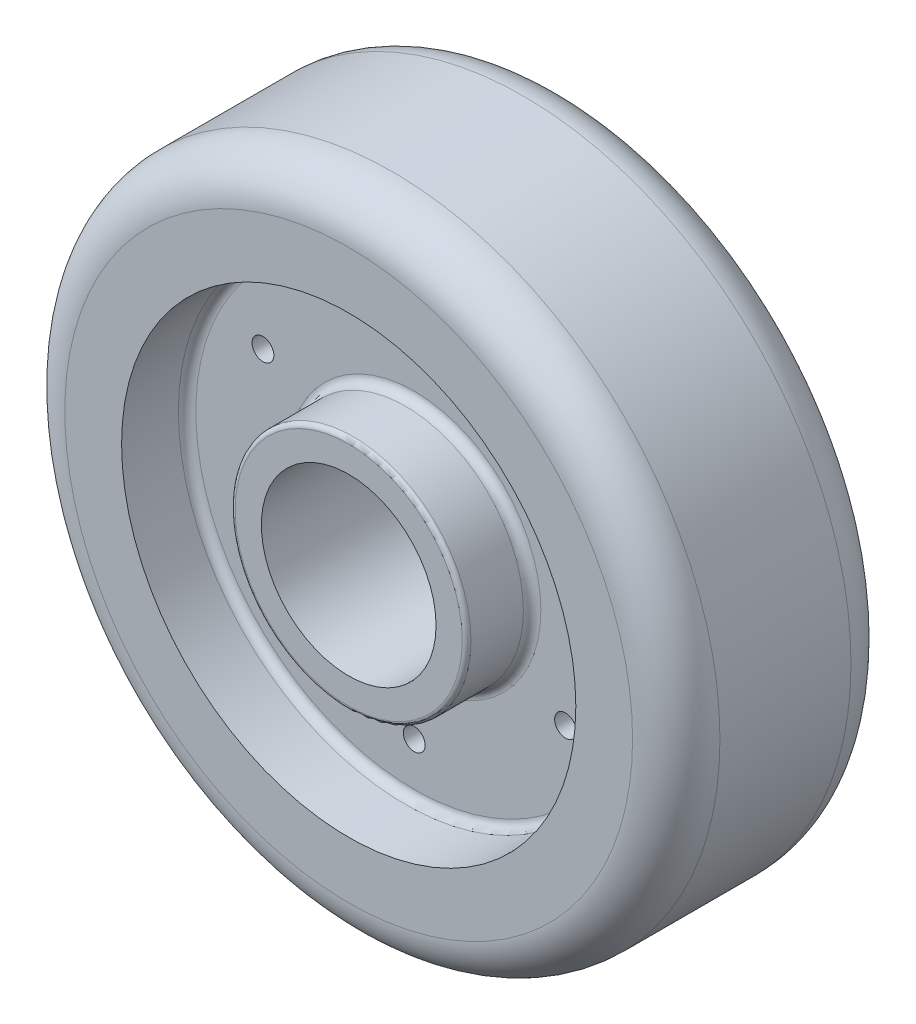
ISO-10303-21;
HEADER;
FILE_DESCRIPTION(('STEP AP214'),'2;1');
FILE_NAME('part.step','',(''),(''),'','','');
FILE_SCHEMA(('AUTOMOTIVE_DESIGN { 1 0 10303 214 1 1 1 1 }'));
ENDSEC;
DATA;
#1=APPLICATION_CONTEXT('core data for automotive mechanical design processes');
#2=APPLICATION_PROTOCOL_DEFINITION('international standard','automotive_design',2000,#1);
#3=PRODUCT_CONTEXT('',#1,'mechanical');
#4=PRODUCT('Part','Part','',(#3));
#5=PRODUCT_RELATED_PRODUCT_CATEGORY('part','',(#4));
#6=PRODUCT_DEFINITION_FORMATION('','',#4);
#7=PRODUCT_DEFINITION_CONTEXT('part definition',#1,'design');
#8=PRODUCT_DEFINITION('design','',#6,#7);
#9=PRODUCT_DEFINITION_SHAPE('','',#8);
#10=(LENGTH_UNIT() NAMED_UNIT(*) SI_UNIT(.MILLI.,.METRE.));
#11=(NAMED_UNIT(*) PLANE_ANGLE_UNIT() SI_UNIT($,.RADIAN.));
#12=(NAMED_UNIT(*) SI_UNIT($,.STERADIAN.) SOLID_ANGLE_UNIT());
#13=UNCERTAINTY_MEASURE_WITH_UNIT(LENGTH_MEASURE(1.E-05),#10,'distance_accuracy_value','');
#14=(GEOMETRIC_REPRESENTATION_CONTEXT(3) GLOBAL_UNCERTAINTY_ASSIGNED_CONTEXT((#13)) GLOBAL_UNIT_ASSIGNED_CONTEXT((#10,
#11,#12)) REPRESENTATION_CONTEXT('',''));
#15=CARTESIAN_POINT('',(0.,0.,0.));
#16=DIRECTION('',(0.,0.,1.));
#17=DIRECTION('',(1.,0.,0.));
#18=AXIS2_PLACEMENT_3D('',#15,#16,#17);
#19=CARTESIAN_POINT('',(0.,0.,25.));
#20=DIRECTION('',(0.,0.,-1.));
#21=DIRECTION('',(-1.,0.,0.));
#22=AXIS2_PLACEMENT_3D('',#19,#20,#21);
#23=CYLINDRICAL_SURFACE('',#22,75.);
#24=CARTESIAN_POINT('',(0.,0.,-15.));
#25=DIRECTION('',(0.,0.,1.));
#26=DIRECTION('',(1.,0.,0.));
#27=AXIS2_PLACEMENT_3D('',#24,#25,#26);
#28=CIRCLE('',#27,75.);
#29=CARTESIAN_POINT('',(75.,0.,-15.));
#30=VERTEX_POINT('',#29);
#31=EDGE_CURVE('E94',#30,#30,#28,.T.);
#32=ORIENTED_EDGE('',*,*,#31,.T.);
#33=EDGE_LOOP('',(#32));
#34=FACE_BOUND('',#33,.T.);
#35=CARTESIAN_POINT('',(0.,0.,15.));
#36=DIRECTION('',(0.,0.,1.));
#37=DIRECTION('',(1.,0.,0.));
#38=AXIS2_PLACEMENT_3D('',#35,#36,#37);
#39=CIRCLE('',#38,75.);
#40=CARTESIAN_POINT('',(75.,0.,15.));
#41=VERTEX_POINT('',#40);
#42=EDGE_CURVE('E91',#41,#41,#39,.F.);
#43=ORIENTED_EDGE('',*,*,#42,.T.);
#44=EDGE_LOOP('',(#43));
#45=FACE_BOUND('',#44,.T.);
#46=ADVANCED_FACE('F37',(#34,#45),#23,.T.);
#47=CARTESIAN_POINT('',(0.,0.,25.));
#48=DIRECTION('',(0.,0.,1.));
#49=DIRECTION('',(1.,0.,0.));
#50=AXIS2_PLACEMENT_3D('',#47,#48,#49);
#51=PLANE('',#50);
#52=CARTESIAN_POINT('',(0.,0.,25.));
#53=DIRECTION('',(0.,0.,1.));
#54=DIRECTION('',(1.,0.,0.));
#55=AXIS2_PLACEMENT_3D('',#52,#53,#54);
#56=CIRCLE('',#55,65.);
#57=CARTESIAN_POINT('',(65.,0.,25.));
#58=VERTEX_POINT('',#57);
#59=EDGE_CURVE('E100',#58,#58,#56,.T.);
#60=ORIENTED_EDGE('',*,*,#59,.T.);
#61=EDGE_LOOP('',(#60));
#62=FACE_BOUND('',#61,.T.);
#63=CARTESIAN_POINT('',(0.,0.,25.));
#64=DIRECTION('',(0.,0.,1.));
#65=DIRECTION('',(1.,0.,0.));
#66=AXIS2_PLACEMENT_3D('',#63,#64,#65);
#67=CIRCLE('',#66,52.);
#68=CARTESIAN_POINT('',(52.,0.,25.));
#69=VERTEX_POINT('',#68);
#70=EDGE_CURVE('E88',#69,#69,#67,.T.);
#71=ORIENTED_EDGE('',*,*,#70,.F.);
#72=EDGE_LOOP('',(#71));
#73=FACE_BOUND('',#72,.T.);
#74=ADVANCED_FACE('F149',(#62,#73),#51,.T.);
#75=CARTESIAN_POINT('',(0.,0.,-25.));
#76=DIRECTION('',(0.,0.,1.));
#77=DIRECTION('',(1.,0.,0.));
#78=AXIS2_PLACEMENT_3D('',#75,#76,#77);
#79=PLANE('',#78);
#80=CARTESIAN_POINT('',(0.,0.,-25.));
#81=DIRECTION('',(0.,0.,1.));
#82=DIRECTION('',(1.,0.,0.));
#83=AXIS2_PLACEMENT_3D('',#80,#81,#82);
#84=CIRCLE('',#83,65.);
#85=CARTESIAN_POINT('',(65.,0.,-25.));
#86=VERTEX_POINT('',#85);
#87=EDGE_CURVE('E97',#86,#86,#84,.F.);
#88=ORIENTED_EDGE('',*,*,#87,.T.);
#89=EDGE_LOOP('',(#88));
#90=FACE_BOUND('',#89,.T.);
#91=CARTESIAN_POINT('',(0.,0.,-25.));
#92=DIRECTION('',(0.,0.,-1.));
#93=DIRECTION('',(-1.,0.,0.));
#94=AXIS2_PLACEMENT_3D('',#91,#92,#93);
#95=CIRCLE('',#94,52.);
#96=CARTESIAN_POINT('',(-52.,0.,-25.));
#97=VERTEX_POINT('',#96);
#98=EDGE_CURVE('E80',#97,#97,#95,.T.);
#99=ORIENTED_EDGE('',*,*,#98,.F.);
#100=EDGE_LOOP('',(#99));
#101=FACE_BOUND('',#100,.T.);
#102=ADVANCED_FACE('F155',(#90,#101),#79,.F.);
#103=CARTESIAN_POINT('',(0.,0.,10.));
#104=DIRECTION('',(0.,0.,1.));
#105=DIRECTION('',(1.,0.,0.));
#106=AXIS2_PLACEMENT_3D('',#103,#104,#105);
#107=CYLINDRICAL_SURFACE('',#106,52.);
#108=CARTESIAN_POINT('',(0.,0.,12.));
#109=DIRECTION('',(0.,0.,1.));
#110=DIRECTION('',(1.,0.,0.));
#111=AXIS2_PLACEMENT_3D('',#108,#109,#110);
#112=CIRCLE('',#111,52.);
#113=CARTESIAN_POINT('',(52.,0.,12.));
#114=VERTEX_POINT('',#113);
#115=EDGE_CURVE('E106',#114,#114,#112,.F.);
#116=ORIENTED_EDGE('',*,*,#115,.T.);
#117=EDGE_LOOP('',(#116));
#118=FACE_BOUND('',#117,.T.);
#119=ORIENTED_EDGE('',*,*,#70,.T.);
#120=EDGE_LOOP('',(#119));
#121=FACE_BOUND('',#120,.T.);
#122=ADVANCED_FACE('F218',(#118,#121),#107,.F.);
#123=CARTESIAN_POINT('',(0.,0.,10.));
#124=DIRECTION('',(0.,0.,1.));
#125=DIRECTION('',(1.,0.,0.));
#126=AXIS2_PLACEMENT_3D('',#123,#124,#125);
#127=PLANE('',#126);
#128=CARTESIAN_POINT('',(0.,40.,10.));
#129=DIRECTION('',(0.,0.,1.));
#130=DIRECTION('',(1.,0.,0.));
#131=AXIS2_PLACEMENT_3D('',#128,#129,#130);
#132=CIRCLE('',#131,2.5);
#133=CARTESIAN_POINT('',(2.5,40.,10.));
#134=VERTEX_POINT('',#133);
#135=EDGE_CURVE('E58',#134,#134,#132,.T.);
#136=ORIENTED_EDGE('',*,*,#135,.F.);
#137=EDGE_LOOP('',(#136));
#138=FACE_BOUND('',#137,.T.);
#139=CARTESIAN_POINT('',(-34.6410161513767,19.9999999999985,10.));
#140=DIRECTION('',(0.,0.,1.));
#141=DIRECTION('',(1.,0.,0.));
#142=AXIS2_PLACEMENT_3D('',#139,#140,#141);
#143=CIRCLE('',#142,2.50000000000173);
#144=CARTESIAN_POINT('',(-32.141016151375,19.9999999999985,10.));
#145=VERTEX_POINT('',#144);
#146=EDGE_CURVE('E418',#145,#145,#143,.T.);
#147=ORIENTED_EDGE('',*,*,#146,.F.);
#148=EDGE_LOOP('',(#147));
#149=FACE_BOUND('',#148,.T.);
#150=CARTESIAN_POINT('',(-34.641016151375,-20.0000000000015,10.));
#151=DIRECTION('',(0.,0.,1.));
#152=DIRECTION('',(1.,0.,0.));
#153=AXIS2_PLACEMENT_3D('',#150,#151,#152);
#154=CIRCLE('',#153,2.50000000000323);
#155=CARTESIAN_POINT('',(-32.1410161513718,-20.0000000000015,10.));
#156=VERTEX_POINT('',#155);
#157=EDGE_CURVE('E83',#156,#156,#154,.T.);
#158=ORIENTED_EDGE('',*,*,#157,.F.);
#159=EDGE_LOOP('',(#158));
#160=FACE_BOUND('',#159,.T.);
#161=CARTESIAN_POINT('',(3.39590937005871E-12,-40.,10.));
#162=DIRECTION('',(0.,0.,1.));
#163=DIRECTION('',(1.,0.,0.));
#164=AXIS2_PLACEMENT_3D('',#161,#162,#163);
#165=CIRCLE('',#164,2.50000000000352);
#166=CARTESIAN_POINT('',(2.50000000000691,-40.,10.));
#167=VERTEX_POINT('',#166);
#168=EDGE_CURVE('E422',#167,#167,#165,.T.);
#169=ORIENTED_EDGE('',*,*,#168,.F.);
#170=EDGE_LOOP('',(#169));
#171=FACE_BOUND('',#170,.T.);
#172=CARTESIAN_POINT('',(34.6410161513801,-19.9999999999985,10.));
#173=DIRECTION('',(0.,0.,1.));
#174=DIRECTION('',(1.,0.,0.));
#175=AXIS2_PLACEMENT_3D('',#172,#173,#174);
#176=CIRCLE('',#175,2.50000000000219);
#177=CARTESIAN_POINT('',(37.1410161513823,-19.9999999999985,10.));
#178=VERTEX_POINT('',#177);
#179=EDGE_CURVE('E415',#178,#178,#176,.T.);
#180=ORIENTED_EDGE('',*,*,#179,.F.);
#181=EDGE_LOOP('',(#180));
#182=FACE_BOUND('',#181,.T.);
#183=CARTESIAN_POINT('',(34.6410161513784,20.0000000000015,10.));
#184=DIRECTION('',(0.,0.,1.));
#185=DIRECTION('',(1.,0.,0.));
#186=AXIS2_PLACEMENT_3D('',#183,#184,#185);
#187=CIRCLE('',#186,2.50000000000049);
#188=CARTESIAN_POINT('',(37.1410161513789,20.0000000000015,10.));
#189=VERTEX_POINT('',#188);
#190=EDGE_CURVE('E412',#189,#189,#187,.T.);
#191=ORIENTED_EDGE('',*,*,#190,.F.);
#192=EDGE_LOOP('',(#191));
#193=FACE_BOUND('',#192,.T.);
#194=CARTESIAN_POINT('',(0.,0.,10.));
#195=DIRECTION('',(0.,0.,1.));
#196=DIRECTION('',(1.,0.,0.));
#197=AXIS2_PLACEMENT_3D('',#194,#195,#196);
#198=CIRCLE('',#197,29.);
#199=CARTESIAN_POINT('',(29.,0.,10.));
#200=VERTEX_POINT('',#199);
#201=EDGE_CURVE('E112',#200,#200,#198,.F.);
#202=ORIENTED_EDGE('',*,*,#201,.T.);
#203=EDGE_LOOP('',(#202));
#204=FACE_BOUND('',#203,.T.);
#205=CARTESIAN_POINT('',(0.,0.,10.));
#206=DIRECTION('',(0.,0.,1.));
#207=DIRECTION('',(1.,0.,0.));
#208=AXIS2_PLACEMENT_3D('',#205,#206,#207);
#209=CIRCLE('',#208,50.);
#210=CARTESIAN_POINT('',(50.,0.,10.));
#211=VERTEX_POINT('',#210);
#212=EDGE_CURVE('E103',#211,#211,#209,.T.);
#213=ORIENTED_EDGE('',*,*,#212,.T.);
#214=EDGE_LOOP('',(#213));
#215=FACE_BOUND('',#214,.T.);
#216=ADVANCED_FACE('F214',(#138,#149,#160,#171,#182,#193,#204,#215),#127,.T.);
#217=CARTESIAN_POINT('',(0.,0.,-10.));
#218=DIRECTION('',(0.,0.,-1.));
#219=DIRECTION('',(-1.,0.,0.));
#220=AXIS2_PLACEMENT_3D('',#217,#218,#219);
#221=CYLINDRICAL_SURFACE('',#220,52.);
#222=CARTESIAN_POINT('',(0.,0.,-12.));
#223=DIRECTION('',(0.,0.,-1.));
#224=DIRECTION('',(-1.,0.,0.));
#225=AXIS2_PLACEMENT_3D('',#222,#223,#224);
#226=CIRCLE('',#225,52.);
#227=CARTESIAN_POINT('',(-52.,0.,-12.));
#228=VERTEX_POINT('',#227);
#229=EDGE_CURVE('E127',#228,#228,#226,.F.);
#230=ORIENTED_EDGE('',*,*,#229,.T.);
#231=EDGE_LOOP('',(#230));
#232=FACE_BOUND('',#231,.T.);
#233=ORIENTED_EDGE('',*,*,#98,.T.);
#234=EDGE_LOOP('',(#233));
#235=FACE_BOUND('',#234,.T.);
#236=ADVANCED_FACE('F210',(#232,#235),#221,.F.);
#237=CARTESIAN_POINT('',(0.,0.,-10.));
#238=DIRECTION('',(0.,0.,-1.));
#239=DIRECTION('',(-1.,0.,0.));
#240=AXIS2_PLACEMENT_3D('',#237,#238,#239);
#241=PLANE('',#240);
#242=CARTESIAN_POINT('',(0.,40.,-10.));
#243=DIRECTION('',(0.,0.,-1.));
#244=DIRECTION('',(-1.,0.,0.));
#245=AXIS2_PLACEMENT_3D('',#242,#243,#244);
#246=CIRCLE('',#245,2.5);
#247=CARTESIAN_POINT('',(-2.5,40.,-10.));
#248=VERTEX_POINT('',#247);
#249=EDGE_CURVE('E41',#248,#248,#246,.T.);
#250=ORIENTED_EDGE('',*,*,#249,.F.);
#251=EDGE_LOOP('',(#250));
#252=FACE_BOUND('',#251,.T.);
#253=CARTESIAN_POINT('',(-34.6410161513767,19.9999999999985,-10.));
#254=DIRECTION('',(0.,0.,-1.));
#255=DIRECTION('',(-1.,0.,0.));
#256=AXIS2_PLACEMENT_3D('',#253,#254,#255);
#257=CIRCLE('',#256,2.50000000000173);
#258=CARTESIAN_POINT('',(-37.1410161513784,19.9999999999985,-10.));
#259=VERTEX_POINT('',#258);
#260=EDGE_CURVE('E66',#259,#259,#257,.T.);
#261=ORIENTED_EDGE('',*,*,#260,.F.);
#262=EDGE_LOOP('',(#261));
#263=FACE_BOUND('',#262,.T.);
#264=CARTESIAN_POINT('',(-34.641016151375,-20.0000000000015,-10.));
#265=DIRECTION('',(0.,0.,-1.));
#266=DIRECTION('',(-1.,0.,0.));
#267=AXIS2_PLACEMENT_3D('',#264,#265,#266);
#268=CIRCLE('',#267,2.50000000000323);
#269=CARTESIAN_POINT('',(-37.1410161513782,-20.0000000000015,-10.));
#270=VERTEX_POINT('',#269);
#271=EDGE_CURVE('E64',#270,#270,#268,.T.);
#272=ORIENTED_EDGE('',*,*,#271,.F.);
#273=EDGE_LOOP('',(#272));
#274=FACE_BOUND('',#273,.T.);
#275=CARTESIAN_POINT('',(3.39590937005871E-12,-40.,-10.));
#276=DIRECTION('',(0.,0.,-1.));
#277=DIRECTION('',(-1.,0.,0.));
#278=AXIS2_PLACEMENT_3D('',#275,#276,#277);
#279=CIRCLE('',#278,2.50000000000352);
#280=CARTESIAN_POINT('',(-2.50000000000012,-40.,-10.));
#281=VERTEX_POINT('',#280);
#282=EDGE_CURVE('E61',#281,#281,#279,.T.);
#283=ORIENTED_EDGE('',*,*,#282,.F.);
#284=EDGE_LOOP('',(#283));
#285=FACE_BOUND('',#284,.T.);
#286=CARTESIAN_POINT('',(34.6410161513801,-19.9999999999985,-10.));
#287=DIRECTION('',(0.,0.,-1.));
#288=DIRECTION('',(-1.,0.,0.));
#289=AXIS2_PLACEMENT_3D('',#286,#287,#288);
#290=CIRCLE('',#289,2.50000000000219);
#291=CARTESIAN_POINT('',(32.1410161513779,-19.9999999999985,-10.));
#292=VERTEX_POINT('',#291);
#293=EDGE_CURVE('E57',#292,#292,#290,.T.);
#294=ORIENTED_EDGE('',*,*,#293,.F.);
#295=EDGE_LOOP('',(#294));
#296=FACE_BOUND('',#295,.T.);
#297=CARTESIAN_POINT('',(34.6410161513784,20.0000000000015,-10.));
#298=DIRECTION('',(0.,0.,-1.));
#299=DIRECTION('',(-1.,0.,0.));
#300=AXIS2_PLACEMENT_3D('',#297,#298,#299);
#301=CIRCLE('',#300,2.50000000000049);
#302=CARTESIAN_POINT('',(32.1410161513779,20.0000000000015,-10.));
#303=VERTEX_POINT('',#302);
#304=EDGE_CURVE('E54',#303,#303,#301,.T.);
#305=ORIENTED_EDGE('',*,*,#304,.F.);
#306=EDGE_LOOP('',(#305));
#307=FACE_BOUND('',#306,.T.);
#308=CARTESIAN_POINT('',(0.,0.,-10.));
#309=DIRECTION('',(0.,0.,-1.));
#310=DIRECTION('',(-1.,0.,0.));
#311=AXIS2_PLACEMENT_3D('',#308,#309,#310);
#312=CIRCLE('',#311,50.);
#313=CARTESIAN_POINT('',(-50.,0.,-10.));
#314=VERTEX_POINT('',#313);
#315=EDGE_CURVE('E124',#314,#314,#312,.T.);
#316=ORIENTED_EDGE('',*,*,#315,.T.);
#317=EDGE_LOOP('',(#316));
#318=FACE_BOUND('',#317,.T.);
#319=CARTESIAN_POINT('',(0.,0.,-10.));
#320=DIRECTION('',(0.,0.,-1.));
#321=DIRECTION('',(-1.,0.,0.));
#322=AXIS2_PLACEMENT_3D('',#319,#320,#321);
#323=CIRCLE('',#322,29.);
#324=CARTESIAN_POINT('',(-29.,0.,-10.));
#325=VERTEX_POINT('',#324);
#326=EDGE_CURVE('E121',#325,#325,#323,.F.);
#327=ORIENTED_EDGE('',*,*,#326,.T.);
#328=EDGE_LOOP('',(#327));
#329=FACE_BOUND('',#328,.T.);
#330=ADVANCED_FACE('F194',(#252,#263,#274,#285,#296,#307,#318,#329),#241,.T.);
#331=CARTESIAN_POINT('',(0.,0.,25.));
#332=DIRECTION('',(0.,0.,1.));
#333=DIRECTION('',(1.,0.,0.));
#334=AXIS2_PLACEMENT_3D('',#331,#332,#333);
#335=PLANE('',#334);
#336=CARTESIAN_POINT('',(0.,0.,25.));
#337=DIRECTION('',(0.,0.,1.));
#338=DIRECTION('',(1.,0.,0.));
#339=AXIS2_PLACEMENT_3D('',#336,#337,#338);
#340=CIRCLE('',#339,26.);
#341=CARTESIAN_POINT('',(26.,0.,25.));
#342=VERTEX_POINT('',#341);
#343=EDGE_CURVE('E115',#342,#342,#340,.T.);
#344=ORIENTED_EDGE('',*,*,#343,.T.);
#345=EDGE_LOOP('',(#344));
#346=FACE_BOUND('',#345,.T.);
#347=CARTESIAN_POINT('',(0.,0.,25.));
#348=DIRECTION('',(0.,0.,1.));
#349=DIRECTION('',(1.,0.,0.));
#350=AXIS2_PLACEMENT_3D('',#347,#348,#349);
#351=CIRCLE('',#350,20.);
#352=CARTESIAN_POINT('',(20.,0.,25.));
#353=VERTEX_POINT('',#352);
#354=EDGE_CURVE('E75',#353,#353,#351,.T.);
#355=ORIENTED_EDGE('',*,*,#354,.F.);
#356=EDGE_LOOP('',(#355));
#357=FACE_BOUND('',#356,.T.);
#358=ADVANCED_FACE('F190',(#346,#357),#335,.T.);
#359=CARTESIAN_POINT('',(0.,0.,25.));
#360=DIRECTION('',(0.,0.,-1.));
#361=DIRECTION('',(-1.,0.,0.));
#362=AXIS2_PLACEMENT_3D('',#359,#360,#361);
#363=CYLINDRICAL_SURFACE('',#362,27.);
#364=CARTESIAN_POINT('',(0.,0.,24.));
#365=DIRECTION('',(0.,0.,1.));
#366=DIRECTION('',(1.,0.,0.));
#367=AXIS2_PLACEMENT_3D('',#364,#365,#366);
#368=CIRCLE('',#367,27.);
#369=CARTESIAN_POINT('',(27.,0.,24.));
#370=VERTEX_POINT('',#369);
#371=EDGE_CURVE('E118',#370,#370,#368,.F.);
#372=ORIENTED_EDGE('',*,*,#371,.T.);
#373=EDGE_LOOP('',(#372));
#374=FACE_BOUND('',#373,.T.);
#375=CARTESIAN_POINT('',(0.,0.,12.));
#376=DIRECTION('',(0.,0.,1.));
#377=DIRECTION('',(1.,0.,0.));
#378=AXIS2_PLACEMENT_3D('',#375,#376,#377);
#379=CIRCLE('',#378,27.);
#380=CARTESIAN_POINT('',(27.,0.,12.));
#381=VERTEX_POINT('',#380);
#382=EDGE_CURVE('E109',#381,#381,#379,.T.);
#383=ORIENTED_EDGE('',*,*,#382,.T.);
#384=EDGE_LOOP('',(#383));
#385=FACE_BOUND('',#384,.T.);
#386=ADVANCED_FACE('F193',(#374,#385),#363,.T.);
#387=CARTESIAN_POINT('',(0.,0.,25.));
#388=DIRECTION('',(0.,0.,-1.));
#389=DIRECTION('',(-1.,0.,0.));
#390=AXIS2_PLACEMENT_3D('',#387,#388,#389);
#391=CYLINDRICAL_SURFACE('',#390,20.);
#392=ORIENTED_EDGE('',*,*,#354,.T.);
#393=EDGE_LOOP('',(#392));
#394=FACE_BOUND('',#393,.T.);
#395=CARTESIAN_POINT('',(0.,0.,-25.));
#396=DIRECTION('',(0.,0.,1.));
#397=DIRECTION('',(1.,0.,0.));
#398=AXIS2_PLACEMENT_3D('',#395,#396,#397);
#399=CIRCLE('',#398,20.);
#400=CARTESIAN_POINT('',(20.,0.,-25.));
#401=VERTEX_POINT('',#400);
#402=EDGE_CURVE('E71',#401,#401,#399,.T.);
#403=ORIENTED_EDGE('',*,*,#402,.F.);
#404=EDGE_LOOP('',(#403));
#405=FACE_BOUND('',#404,.T.);
#406=ADVANCED_FACE('F165',(#394,#405),#391,.F.);
#407=CARTESIAN_POINT('',(0.,0.,-15.));
#408=DIRECTION('',(0.,0.,1.));
#409=DIRECTION('',(1.,0.,0.));
#410=AXIS2_PLACEMENT_3D('',#407,#408,#409);
#411=TOROIDAL_SURFACE('',#410,65.,10.);
#412=ORIENTED_EDGE('',*,*,#87,.F.);
#413=EDGE_LOOP('',(#412));
#414=FACE_BOUND('',#413,.T.);
#415=ORIENTED_EDGE('',*,*,#31,.F.);
#416=EDGE_LOOP('',(#415));
#417=FACE_BOUND('',#416,.T.);
#418=ADVANCED_FACE('F161',(#414,#417),#411,.T.);
#419=CARTESIAN_POINT('',(0.,0.,15.));
#420=DIRECTION('',(0.,0.,1.));
#421=DIRECTION('',(1.,0.,0.));
#422=AXIS2_PLACEMENT_3D('',#419,#420,#421);
#423=TOROIDAL_SURFACE('',#422,65.,10.);
#424=ORIENTED_EDGE('',*,*,#42,.F.);
#425=EDGE_LOOP('',(#424));
#426=FACE_BOUND('',#425,.T.);
#427=ORIENTED_EDGE('',*,*,#59,.F.);
#428=EDGE_LOOP('',(#427));
#429=FACE_BOUND('',#428,.T.);
#430=ADVANCED_FACE('F164',(#426,#429),#423,.T.);
#431=CARTESIAN_POINT('',(0.,0.,12.));
#432=DIRECTION('',(0.,0.,1.));
#433=DIRECTION('',(1.,0.,0.));
#434=AXIS2_PLACEMENT_3D('',#431,#432,#433);
#435=TOROIDAL_SURFACE('',#434,50.,2.);
#436=ORIENTED_EDGE('',*,*,#115,.F.);
#437=EDGE_LOOP('',(#436));
#438=FACE_BOUND('',#437,.T.);
#439=ORIENTED_EDGE('',*,*,#212,.F.);
#440=EDGE_LOOP('',(#439));
#441=FACE_BOUND('',#440,.T.);
#442=ADVANCED_FACE('F169',(#438,#441),#435,.F.);
#443=CARTESIAN_POINT('',(0.,0.,12.));
#444=DIRECTION('',(0.,0.,1.));
#445=DIRECTION('',(1.,0.,0.));
#446=AXIS2_PLACEMENT_3D('',#443,#444,#445);
#447=TOROIDAL_SURFACE('',#446,29.,2.);
#448=ORIENTED_EDGE('',*,*,#201,.F.);
#449=EDGE_LOOP('',(#448));
#450=FACE_BOUND('',#449,.T.);
#451=ORIENTED_EDGE('',*,*,#382,.F.);
#452=EDGE_LOOP('',(#451));
#453=FACE_BOUND('',#452,.T.);
#454=ADVANCED_FACE('F173',(#450,#453),#447,.F.);
#455=CARTESIAN_POINT('',(0.,0.,24.));
#456=DIRECTION('',(0.,0.,1.));
#457=DIRECTION('',(1.,0.,0.));
#458=AXIS2_PLACEMENT_3D('',#455,#456,#457);
#459=TOROIDAL_SURFACE('',#458,26.,1.);
#460=ORIENTED_EDGE('',*,*,#371,.F.);
#461=EDGE_LOOP('',(#460));
#462=FACE_BOUND('',#461,.T.);
#463=ORIENTED_EDGE('',*,*,#343,.F.);
#464=EDGE_LOOP('',(#463));
#465=FACE_BOUND('',#464,.T.);
#466=ADVANCED_FACE('F177',(#462,#465),#459,.T.);
#467=CARTESIAN_POINT('',(0.,0.,-25.));
#468=DIRECTION('',(0.,0.,1.));
#469=DIRECTION('',(1.,0.,0.));
#470=AXIS2_PLACEMENT_3D('',#467,#468,#469);
#471=CYLINDRICAL_SURFACE('',#470,27.);
#472=CARTESIAN_POINT('',(0.,0.,-24.));
#473=DIRECTION('',(0.,0.,-1.));
#474=DIRECTION('',(-1.,0.,0.));
#475=AXIS2_PLACEMENT_3D('',#472,#473,#474);
#476=CIRCLE('',#475,27.);
#477=CARTESIAN_POINT('',(-27.,0.,-24.));
#478=VERTEX_POINT('',#477);
#479=EDGE_CURVE('E45',#478,#478,#476,.F.);
#480=ORIENTED_EDGE('',*,*,#479,.T.);
#481=EDGE_LOOP('',(#480));
#482=FACE_BOUND('',#481,.T.);
#483=CARTESIAN_POINT('',(0.,0.,-12.));
#484=DIRECTION('',(0.,0.,-1.));
#485=DIRECTION('',(-1.,0.,0.));
#486=AXIS2_PLACEMENT_3D('',#483,#484,#485);
#487=CIRCLE('',#486,27.);
#488=CARTESIAN_POINT('',(-27.,0.,-12.));
#489=VERTEX_POINT('',#488);
#490=EDGE_CURVE('E50',#489,#489,#487,.T.);
#491=ORIENTED_EDGE('',*,*,#490,.T.);
#492=EDGE_LOOP('',(#491));
#493=FACE_BOUND('',#492,.T.);
#494=ADVANCED_FACE('F132',(#482,#493),#471,.T.);
#495=CARTESIAN_POINT('',(0.,0.,-25.));
#496=DIRECTION('',(0.,0.,-1.));
#497=DIRECTION('',(1.,0.,0.));
#498=AXIS2_PLACEMENT_3D('',#495,#496,#497);
#499=PLANE('',#498);
#500=CARTESIAN_POINT('',(0.,0.,-25.));
#501=DIRECTION('',(0.,0.,-1.));
#502=DIRECTION('',(-1.,0.,0.));
#503=AXIS2_PLACEMENT_3D('',#500,#501,#502);
#504=CIRCLE('',#503,26.);
#505=CARTESIAN_POINT('',(-26.,0.,-25.));
#506=VERTEX_POINT('',#505);
#507=EDGE_CURVE('E10',#506,#506,#504,.T.);
#508=ORIENTED_EDGE('',*,*,#507,.T.);
#509=EDGE_LOOP('',(#508));
#510=FACE_BOUND('',#509,.T.);
#511=ORIENTED_EDGE('',*,*,#402,.T.);
#512=EDGE_LOOP('',(#511));
#513=FACE_BOUND('',#512,.T.);
#514=ADVANCED_FACE('F144',(#510,#513),#499,.T.);
#515=CARTESIAN_POINT('',(0.,0.,-12.));
#516=DIRECTION('',(0.,0.,-1.));
#517=DIRECTION('',(-1.,0.,0.));
#518=AXIS2_PLACEMENT_3D('',#515,#516,#517);
#519=TOROIDAL_SURFACE('',#518,50.,2.);
#520=ORIENTED_EDGE('',*,*,#229,.F.);
#521=EDGE_LOOP('',(#520));
#522=FACE_BOUND('',#521,.T.);
#523=ORIENTED_EDGE('',*,*,#315,.F.);
#524=EDGE_LOOP('',(#523));
#525=FACE_BOUND('',#524,.T.);
#526=ADVANCED_FACE('F136',(#522,#525),#519,.F.);
#527=CARTESIAN_POINT('',(0.,0.,-12.));
#528=DIRECTION('',(0.,0.,-1.));
#529=DIRECTION('',(-1.,0.,0.));
#530=AXIS2_PLACEMENT_3D('',#527,#528,#529);
#531=TOROIDAL_SURFACE('',#530,29.,2.);
#532=ORIENTED_EDGE('',*,*,#326,.F.);
#533=EDGE_LOOP('',(#532));
#534=FACE_BOUND('',#533,.T.);
#535=ORIENTED_EDGE('',*,*,#490,.F.);
#536=EDGE_LOOP('',(#535));
#537=FACE_BOUND('',#536,.T.);
#538=ADVANCED_FACE('F134',(#534,#537),#531,.F.);
#539=CARTESIAN_POINT('',(0.,0.,-24.));
#540=DIRECTION('',(0.,0.,-1.));
#541=DIRECTION('',(-1.,0.,0.));
#542=AXIS2_PLACEMENT_3D('',#539,#540,#541);
#543=TOROIDAL_SURFACE('',#542,26.,1.);
#544=ORIENTED_EDGE('',*,*,#507,.F.);
#545=EDGE_LOOP('',(#544));
#546=FACE_BOUND('',#545,.T.);
#547=ORIENTED_EDGE('',*,*,#479,.F.);
#548=EDGE_LOOP('',(#547));
#549=FACE_BOUND('',#548,.T.);
#550=ADVANCED_FACE('F39',(#546,#549),#543,.T.);
#551=CARTESIAN_POINT('',(34.6410161513784,20.0000000000015,-25.));
#552=DIRECTION('',(0.,0.,1.));
#553=DIRECTION('',(1.,0.,0.));
#554=AXIS2_PLACEMENT_3D('',#551,#552,#553);
#555=CYLINDRICAL_SURFACE('',#554,2.50000000000049);
#556=ORIENTED_EDGE('',*,*,#304,.T.);
#557=EDGE_LOOP('',(#556));
#558=FACE_BOUND('',#557,.T.);
#559=ORIENTED_EDGE('',*,*,#190,.T.);
#560=EDGE_LOOP('',(#559));
#561=FACE_BOUND('',#560,.T.);
#562=ADVANCED_FACE('F142',(#558,#561),#555,.F.);
#563=CARTESIAN_POINT('',(34.6410161513801,-19.9999999999985,-25.));
#564=DIRECTION('',(0.,0.,1.));
#565=DIRECTION('',(1.,0.,0.));
#566=AXIS2_PLACEMENT_3D('',#563,#564,#565);
#567=CYLINDRICAL_SURFACE('',#566,2.50000000000219);
#568=ORIENTED_EDGE('',*,*,#293,.T.);
#569=EDGE_LOOP('',(#568));
#570=FACE_BOUND('',#569,.T.);
#571=ORIENTED_EDGE('',*,*,#179,.T.);
#572=EDGE_LOOP('',(#571));
#573=FACE_BOUND('',#572,.T.);
#574=ADVANCED_FACE('F357',(#570,#573),#567,.F.);
#575=CARTESIAN_POINT('',(3.39590937005871E-12,-40.,-25.));
#576=DIRECTION('',(0.,0.,1.));
#577=DIRECTION('',(1.,0.,0.));
#578=AXIS2_PLACEMENT_3D('',#575,#576,#577);
#579=CYLINDRICAL_SURFACE('',#578,2.50000000000352);
#580=ORIENTED_EDGE('',*,*,#282,.T.);
#581=EDGE_LOOP('',(#580));
#582=FACE_BOUND('',#581,.T.);
#583=ORIENTED_EDGE('',*,*,#168,.T.);
#584=EDGE_LOOP('',(#583));
#585=FACE_BOUND('',#584,.T.);
#586=ADVANCED_FACE('F367',(#582,#585),#579,.F.);
#587=CARTESIAN_POINT('',(-34.641016151375,-20.0000000000015,-25.));
#588=DIRECTION('',(0.,0.,1.));
#589=DIRECTION('',(1.,0.,0.));
#590=AXIS2_PLACEMENT_3D('',#587,#588,#589);
#591=CYLINDRICAL_SURFACE('',#590,2.50000000000323);
#592=ORIENTED_EDGE('',*,*,#271,.T.);
#593=EDGE_LOOP('',(#592));
#594=FACE_BOUND('',#593,.T.);
#595=ORIENTED_EDGE('',*,*,#157,.T.);
#596=EDGE_LOOP('',(#595));
#597=FACE_BOUND('',#596,.T.);
#598=ADVANCED_FACE('F377',(#594,#597),#591,.F.);
#599=CARTESIAN_POINT('',(-34.6410161513767,19.9999999999985,-25.));
#600=DIRECTION('',(0.,0.,1.));
#601=DIRECTION('',(1.,0.,0.));
#602=AXIS2_PLACEMENT_3D('',#599,#600,#601);
#603=CYLINDRICAL_SURFACE('',#602,2.50000000000173);
#604=ORIENTED_EDGE('',*,*,#260,.T.);
#605=EDGE_LOOP('',(#604));
#606=FACE_BOUND('',#605,.T.);
#607=ORIENTED_EDGE('',*,*,#146,.T.);
#608=EDGE_LOOP('',(#607));
#609=FACE_BOUND('',#608,.T.);
#610=ADVANCED_FACE('F387',(#606,#609),#603,.F.);
#611=CARTESIAN_POINT('',(0.,40.,-25.));
#612=DIRECTION('',(0.,0.,1.));
#613=DIRECTION('',(1.,0.,0.));
#614=AXIS2_PLACEMENT_3D('',#611,#612,#613);
#615=CYLINDRICAL_SURFACE('',#614,2.5);
#616=ORIENTED_EDGE('',*,*,#249,.T.);
#617=EDGE_LOOP('',(#616));
#618=FACE_BOUND('',#617,.T.);
#619=ORIENTED_EDGE('',*,*,#135,.T.);
#620=EDGE_LOOP('',(#619));
#621=FACE_BOUND('',#620,.T.);
#622=ADVANCED_FACE('F397',(#618,#621),#615,.F.);
#623=CLOSED_SHELL('',(#46,#74,#102,#122,#216,#236,#330,#358,#386,#406,#418,#430,#442,#454,#466,
#494,#514,#526,#538,#550,#562,#574,#586,#598,#610,#622));
#624=MANIFOLD_SOLID_BREP('B2',#623);
#625=ADVANCED_BREP_SHAPE_REPRESENTATION('',(#18,#624),#14);
#626=SHAPE_DEFINITION_REPRESENTATION(#9,#625);
ENDSEC;
END-ISO-10303-21;
